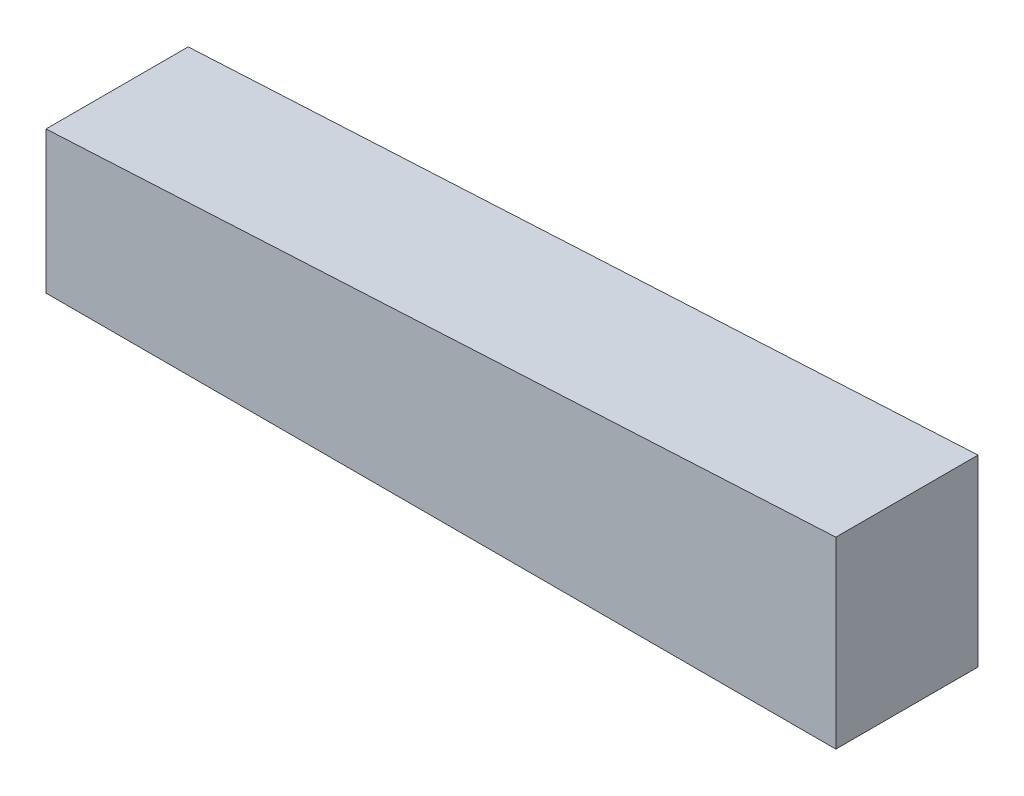
ISO-10303-21;
HEADER;
FILE_DESCRIPTION(('STEP AP214'),'2;1');
FILE_NAME('part.step','',(''),(''),'','','');
FILE_SCHEMA(('AUTOMOTIVE_DESIGN { 1 0 10303 214 1 1 1 1 }'));
ENDSEC;
DATA;
#1=APPLICATION_CONTEXT('core data for automotive mechanical design processes');
#2=APPLICATION_PROTOCOL_DEFINITION('international standard','automotive_design',2000,#1);
#3=PRODUCT_CONTEXT('',#1,'mechanical');
#4=PRODUCT('Part','Part','',(#3));
#5=PRODUCT_RELATED_PRODUCT_CATEGORY('part','',(#4));
#6=PRODUCT_DEFINITION_FORMATION('','',#4);
#7=PRODUCT_DEFINITION_CONTEXT('part definition',#1,'design');
#8=PRODUCT_DEFINITION('design','',#6,#7);
#9=PRODUCT_DEFINITION_SHAPE('','',#8);
#10=(LENGTH_UNIT() NAMED_UNIT(*) SI_UNIT(.MILLI.,.METRE.));
#11=(NAMED_UNIT(*) PLANE_ANGLE_UNIT() SI_UNIT($,.RADIAN.));
#12=(NAMED_UNIT(*) SI_UNIT($,.STERADIAN.) SOLID_ANGLE_UNIT());
#13=UNCERTAINTY_MEASURE_WITH_UNIT(LENGTH_MEASURE(1.E-05),#10,'distance_accuracy_value','');
#14=(GEOMETRIC_REPRESENTATION_CONTEXT(3) GLOBAL_UNCERTAINTY_ASSIGNED_CONTEXT((#13)) GLOBAL_UNIT_ASSIGNED_CONTEXT((#10,
#11,#12)) REPRESENTATION_CONTEXT('',''));
#15=CARTESIAN_POINT('',(0.,0.,0.));
#16=DIRECTION('',(0.,0.,1.));
#17=DIRECTION('',(1.,0.,0.));
#18=AXIS2_PLACEMENT_3D('',#15,#16,#17);
#19=CARTESIAN_POINT('',(0.,0.,4.5));
#20=DIRECTION('',(1.,0.,0.));
#21=DIRECTION('',(0.,0.,-1.));
#22=AXIS2_PLACEMENT_3D('',#19,#20,#21);
#23=PLANE('',#22);
#24=DIRECTION('',(0.,-1.,0.));
#25=VECTOR('',#24,1.);
#26=CARTESIAN_POINT('',(0.,0.,0.));
#27=LINE('',#26,#25);
#28=CARTESIAN_POINT('',(0.,4.5,0.));
#29=VERTEX_POINT('',#28);
#30=CARTESIAN_POINT('',(0.,0.,0.));
#31=VERTEX_POINT('',#30);
#32=EDGE_CURVE('E96',#29,#31,#27,.T.);
#33=ORIENTED_EDGE('',*,*,#32,.T.);
#34=DIRECTION('',(0.,0.,-1.));
#35=VECTOR('',#34,1.);
#36=CARTESIAN_POINT('',(0.,0.,4.5));
#37=LINE('',#36,#35);
#38=CARTESIAN_POINT('',(0.,0.,4.5));
#39=VERTEX_POINT('',#38);
#40=EDGE_CURVE('E11',#39,#31,#37,.T.);
#41=ORIENTED_EDGE('',*,*,#40,.F.);
#42=DIRECTION('',(0.,-1.,0.));
#43=VECTOR('',#42,1.);
#44=CARTESIAN_POINT('',(0.,0.,4.5));
#45=LINE('',#44,#43);
#46=CARTESIAN_POINT('',(0.,4.5,4.5));
#47=VERTEX_POINT('',#46);
#48=EDGE_CURVE('E84',#47,#39,#45,.T.);
#49=ORIENTED_EDGE('',*,*,#48,.F.);
#50=DIRECTION('',(0.,0.,-1.));
#51=VECTOR('',#50,1.);
#52=CARTESIAN_POINT('',(0.,4.5,4.5));
#53=LINE('',#52,#51);
#54=EDGE_CURVE('E92',#47,#29,#53,.T.);
#55=ORIENTED_EDGE('',*,*,#54,.T.);
#56=EDGE_LOOP('',(#33,#41,#49,#55));
#57=FACE_BOUND('',#56,.T.);
#58=ADVANCED_FACE('F33',(#57),#23,.F.);
#59=CARTESIAN_POINT('',(0.,0.,4.5));
#60=DIRECTION('',(0.,1.,0.));
#61=DIRECTION('',(0.,0.,1.));
#62=AXIS2_PLACEMENT_3D('',#59,#60,#61);
#63=PLANE('',#62);
#64=DIRECTION('',(1.,0.,0.));
#65=VECTOR('',#64,1.);
#66=CARTESIAN_POINT('',(0.,0.,0.));
#67=LINE('',#66,#65);
#68=CARTESIAN_POINT('',(25.,0.,0.));
#69=VERTEX_POINT('',#68);
#70=EDGE_CURVE('E88',#31,#69,#67,.T.);
#71=ORIENTED_EDGE('',*,*,#70,.T.);
#72=DIRECTION('',(0.,0.,-1.));
#73=VECTOR('',#72,1.);
#74=CARTESIAN_POINT('',(25.,0.,4.5));
#75=LINE('',#74,#73);
#76=CARTESIAN_POINT('',(25.,0.,4.5));
#77=VERTEX_POINT('',#76);
#78=EDGE_CURVE('E41',#77,#69,#75,.T.);
#79=ORIENTED_EDGE('',*,*,#78,.F.);
#80=DIRECTION('',(1.,0.,0.));
#81=VECTOR('',#80,1.);
#82=CARTESIAN_POINT('',(0.,0.,4.5));
#83=LINE('',#82,#81);
#84=EDGE_CURVE('E79',#39,#77,#83,.T.);
#85=ORIENTED_EDGE('',*,*,#84,.F.);
#86=ORIENTED_EDGE('',*,*,#40,.T.);
#87=EDGE_LOOP('',(#71,#79,#85,#86));
#88=FACE_BOUND('',#87,.T.);
#89=ADVANCED_FACE('F87',(#88),#63,.F.);
#90=CARTESIAN_POINT('',(25.,0.,4.5));
#91=DIRECTION('',(-1.,0.,0.));
#92=DIRECTION('',(0.,0.,1.));
#93=AXIS2_PLACEMENT_3D('',#90,#91,#92);
#94=PLANE('',#93);
#95=DIRECTION('',(0.,1.,0.));
#96=VECTOR('',#95,1.);
#97=CARTESIAN_POINT('',(25.,0.,0.));
#98=LINE('',#97,#96);
#99=CARTESIAN_POINT('',(25.,5.81019448207604,0.));
#100=VERTEX_POINT('',#99);
#101=EDGE_CURVE('E66',#69,#100,#98,.T.);
#102=ORIENTED_EDGE('',*,*,#101,.T.);
#103=DIRECTION('',(0.,0.,-1.));
#104=VECTOR('',#103,1.);
#105=CARTESIAN_POINT('',(25.,5.81019448207604,4.5));
#106=LINE('',#105,#104);
#107=CARTESIAN_POINT('',(25.,5.81019448207604,4.5));
#108=VERTEX_POINT('',#107);
#109=EDGE_CURVE('E89',#108,#100,#106,.T.);
#110=ORIENTED_EDGE('',*,*,#109,.F.);
#111=DIRECTION('',(0.,1.,0.));
#112=VECTOR('',#111,1.);
#113=CARTESIAN_POINT('',(25.,0.,4.5));
#114=LINE('',#113,#112);
#115=EDGE_CURVE('E82',#77,#108,#114,.T.);
#116=ORIENTED_EDGE('',*,*,#115,.F.);
#117=ORIENTED_EDGE('',*,*,#78,.T.);
#118=EDGE_LOOP('',(#102,#110,#116,#117));
#119=FACE_BOUND('',#118,.T.);
#120=ADVANCED_FACE('F90',(#119),#94,.F.);
#121=CARTESIAN_POINT('',(0.,4.5,4.5));
#122=DIRECTION('',(0.0523359562429444,-0.998629534754574,0.));
#123=DIRECTION('',(0.998629534754574,0.0523359562429444,0.));
#124=AXIS2_PLACEMENT_3D('',#121,#122,#123);
#125=PLANE('',#124);
#126=DIRECTION('',(-0.998629534754574,-0.0523359562429444,0.));
#127=VECTOR('',#126,1.);
#128=CARTESIAN_POINT('',(0.,4.5,0.));
#129=LINE('',#128,#127);
#130=EDGE_CURVE('E72',#100,#29,#129,.T.);
#131=ORIENTED_EDGE('',*,*,#130,.T.);
#132=ORIENTED_EDGE('',*,*,#54,.F.);
#133=DIRECTION('',(-0.998629534754574,-0.0523359562429444,0.));
#134=VECTOR('',#133,1.);
#135=CARTESIAN_POINT('',(0.,4.5,4.5));
#136=LINE('',#135,#134);
#137=EDGE_CURVE('E49',#108,#47,#136,.T.);
#138=ORIENTED_EDGE('',*,*,#137,.F.);
#139=ORIENTED_EDGE('',*,*,#109,.T.);
#140=EDGE_LOOP('',(#131,#132,#138,#139));
#141=FACE_BOUND('',#140,.T.);
#142=ADVANCED_FACE('F103',(#141),#125,.F.);
#143=CARTESIAN_POINT('',(0.,0.,4.5));
#144=DIRECTION('',(0.,0.,-1.));
#145=DIRECTION('',(-1.,0.,0.));
#146=AXIS2_PLACEMENT_3D('',#143,#144,#145);
#147=PLANE('',#146);
#148=ORIENTED_EDGE('',*,*,#48,.T.);
#149=ORIENTED_EDGE('',*,*,#84,.T.);
#150=ORIENTED_EDGE('',*,*,#115,.T.);
#151=ORIENTED_EDGE('',*,*,#137,.T.);
#152=EDGE_LOOP('',(#148,#149,#150,#151));
#153=FACE_BOUND('',#152,.T.);
#154=ADVANCED_FACE('F80',(#153),#147,.F.);
#155=CARTESIAN_POINT('',(0.,0.,0.));
#156=DIRECTION('',(0.,0.,-1.));
#157=DIRECTION('',(-1.,0.,0.));
#158=AXIS2_PLACEMENT_3D('',#155,#156,#157);
#159=PLANE('',#158);
#160=ORIENTED_EDGE('',*,*,#32,.F.);
#161=ORIENTED_EDGE('',*,*,#130,.F.);
#162=ORIENTED_EDGE('',*,*,#101,.F.);
#163=ORIENTED_EDGE('',*,*,#70,.F.);
#164=EDGE_LOOP('',(#160,#161,#162,#163));
#165=FACE_BOUND('',#164,.T.);
#166=ADVANCED_FACE('F106',(#165),#159,.T.);
#167=CLOSED_SHELL('',(#58,#89,#120,#142,#154,#166));
#168=MANIFOLD_SOLID_BREP('B2',#167);
#169=ADVANCED_BREP_SHAPE_REPRESENTATION('',(#18,#168),#14);
#170=SHAPE_DEFINITION_REPRESENTATION(#9,#169);
ENDSEC;
END-ISO-10303-21;
